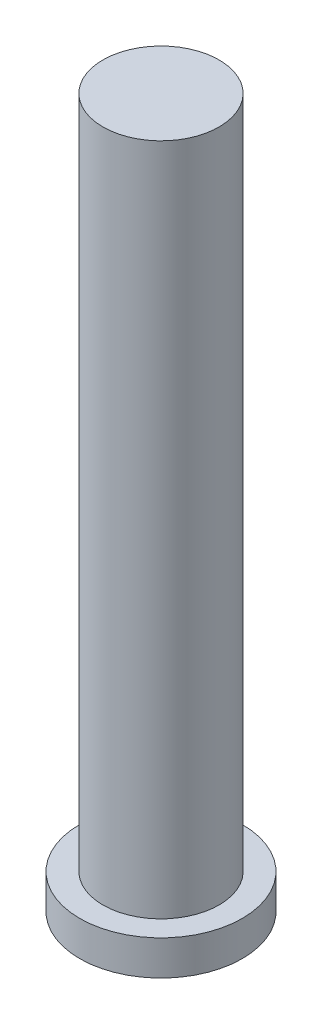
ISO-10303-21;
HEADER;
FILE_DESCRIPTION(('STEP AP214'),'2;1');
FILE_NAME('part.step','',(''),(''),'','','');
FILE_SCHEMA(('AUTOMOTIVE_DESIGN { 1 0 10303 214 1 1 1 1 }'));
ENDSEC;
DATA;
#1=APPLICATION_CONTEXT('core data for automotive mechanical design processes');
#2=APPLICATION_PROTOCOL_DEFINITION('international standard','automotive_design',2000,#1);
#3=PRODUCT_CONTEXT('',#1,'mechanical');
#4=PRODUCT('Part','Part','',(#3));
#5=PRODUCT_RELATED_PRODUCT_CATEGORY('part','',(#4));
#6=PRODUCT_DEFINITION_FORMATION('','',#4);
#7=PRODUCT_DEFINITION_CONTEXT('part definition',#1,'design');
#8=PRODUCT_DEFINITION('design','',#6,#7);
#9=PRODUCT_DEFINITION_SHAPE('','',#8);
#10=(LENGTH_UNIT() NAMED_UNIT(*) SI_UNIT(.MILLI.,.METRE.));
#11=(NAMED_UNIT(*) PLANE_ANGLE_UNIT() SI_UNIT($,.RADIAN.));
#12=(NAMED_UNIT(*) SI_UNIT($,.STERADIAN.) SOLID_ANGLE_UNIT());
#13=UNCERTAINTY_MEASURE_WITH_UNIT(LENGTH_MEASURE(1.E-05),#10,'distance_accuracy_value','');
#14=(GEOMETRIC_REPRESENTATION_CONTEXT(3) GLOBAL_UNCERTAINTY_ASSIGNED_CONTEXT((#13)) GLOBAL_UNIT_ASSIGNED_CONTEXT((#10,
#11,#12)) REPRESENTATION_CONTEXT('',''));
#15=CARTESIAN_POINT('',(0.,0.,0.));
#16=DIRECTION('',(0.,0.,1.));
#17=DIRECTION('',(1.,0.,0.));
#18=AXIS2_PLACEMENT_3D('',#15,#16,#17);
#19=CARTESIAN_POINT('',(0.,3.,0.));
#20=DIRECTION('',(0.,-1.,0.));
#21=DIRECTION('',(0.,0.,-1.));
#22=AXIS2_PLACEMENT_3D('',#19,#20,#21);
#23=CYLINDRICAL_SURFACE('',#22,7.);
#24=CARTESIAN_POINT('',(0.,3.,0.));
#25=DIRECTION('',(0.,1.,0.));
#26=DIRECTION('',(0.,0.,1.));
#27=AXIS2_PLACEMENT_3D('',#24,#25,#26);
#28=CIRCLE('',#27,7.);
#29=CARTESIAN_POINT('',(0.,3.,7.));
#30=VERTEX_POINT('',#29);
#31=EDGE_CURVE('E45',#30,#30,#28,.T.);
#32=ORIENTED_EDGE('',*,*,#31,.F.);
#33=EDGE_LOOP('',(#32));
#34=FACE_BOUND('',#33,.T.);
#35=CARTESIAN_POINT('',(0.,0.,0.));
#36=DIRECTION('',(0.,1.,0.));
#37=DIRECTION('',(0.,0.,1.));
#38=AXIS2_PLACEMENT_3D('',#35,#36,#37);
#39=CIRCLE('',#38,7.);
#40=CARTESIAN_POINT('',(0.,0.,7.));
#41=VERTEX_POINT('',#40);
#42=EDGE_CURVE('E40',#41,#41,#39,.T.);
#43=ORIENTED_EDGE('',*,*,#42,.T.);
#44=EDGE_LOOP('',(#43));
#45=FACE_BOUND('',#44,.T.);
#46=ADVANCED_FACE('F37',(#34,#45),#23,.T.);
#47=CARTESIAN_POINT('',(0.,3.,0.));
#48=DIRECTION('',(0.,1.,0.));
#49=DIRECTION('',(0.,0.,1.));
#50=AXIS2_PLACEMENT_3D('',#47,#48,#49);
#51=PLANE('',#50);
#52=CARTESIAN_POINT('',(0.,3.,0.));
#53=DIRECTION('',(0.,1.,0.));
#54=DIRECTION('',(0.,0.,1.));
#55=AXIS2_PLACEMENT_3D('',#52,#53,#54);
#56=CIRCLE('',#55,5.);
#57=CARTESIAN_POINT('',(0.,3.,5.));
#58=VERTEX_POINT('',#57);
#59=EDGE_CURVE('E10',#58,#58,#56,.T.);
#60=ORIENTED_EDGE('',*,*,#59,.F.);
#61=EDGE_LOOP('',(#60));
#62=FACE_BOUND('',#61,.T.);
#63=ORIENTED_EDGE('',*,*,#31,.T.);
#64=EDGE_LOOP('',(#63));
#65=FACE_BOUND('',#64,.T.);
#66=ADVANCED_FACE('F65',(#62,#65),#51,.T.);
#67=CARTESIAN_POINT('',(0.,0.,0.));
#68=DIRECTION('',(0.,1.,0.));
#69=DIRECTION('',(0.,0.,1.));
#70=AXIS2_PLACEMENT_3D('',#67,#68,#69);
#71=PLANE('',#70);
#72=ORIENTED_EDGE('',*,*,#42,.F.);
#73=EDGE_LOOP('',(#72));
#74=FACE_BOUND('',#73,.T.);
#75=ADVANCED_FACE('F62',(#74),#71,.F.);
#76=CARTESIAN_POINT('',(0.,61.,0.));
#77=DIRECTION('',(0.,-1.,0.));
#78=DIRECTION('',(0.,0.,-1.));
#79=AXIS2_PLACEMENT_3D('',#76,#77,#78);
#80=CYLINDRICAL_SURFACE('',#79,5.);
#81=CARTESIAN_POINT('',(0.,61.,0.));
#82=DIRECTION('',(0.,1.,0.));
#83=DIRECTION('',(0.,0.,1.));
#84=AXIS2_PLACEMENT_3D('',#81,#82,#83);
#85=CIRCLE('',#84,5.);
#86=CARTESIAN_POINT('',(0.,61.,5.));
#87=VERTEX_POINT('',#86);
#88=EDGE_CURVE('E52',#87,#87,#85,.T.);
#89=ORIENTED_EDGE('',*,*,#88,.F.);
#90=EDGE_LOOP('',(#89));
#91=FACE_BOUND('',#90,.T.);
#92=ORIENTED_EDGE('',*,*,#59,.T.);
#93=EDGE_LOOP('',(#92));
#94=FACE_BOUND('',#93,.T.);
#95=ADVANCED_FACE('F64',(#91,#94),#80,.T.);
#96=CARTESIAN_POINT('',(0.,61.,0.));
#97=DIRECTION('',(0.,1.,0.));
#98=DIRECTION('',(0.,0.,1.));
#99=AXIS2_PLACEMENT_3D('',#96,#97,#98);
#100=PLANE('',#99);
#101=ORIENTED_EDGE('',*,*,#88,.T.);
#102=EDGE_LOOP('',(#101));
#103=FACE_BOUND('',#102,.T.);
#104=ADVANCED_FACE('F70',(#103),#100,.T.);
#105=CLOSED_SHELL('',(#46,#66,#75,#95,#104));
#106=MANIFOLD_SOLID_BREP('B2',#105);
#107=ADVANCED_BREP_SHAPE_REPRESENTATION('',(#18,#106),#14);
#108=SHAPE_DEFINITION_REPRESENTATION(#9,#107);
ENDSEC;
END-ISO-10303-21;
